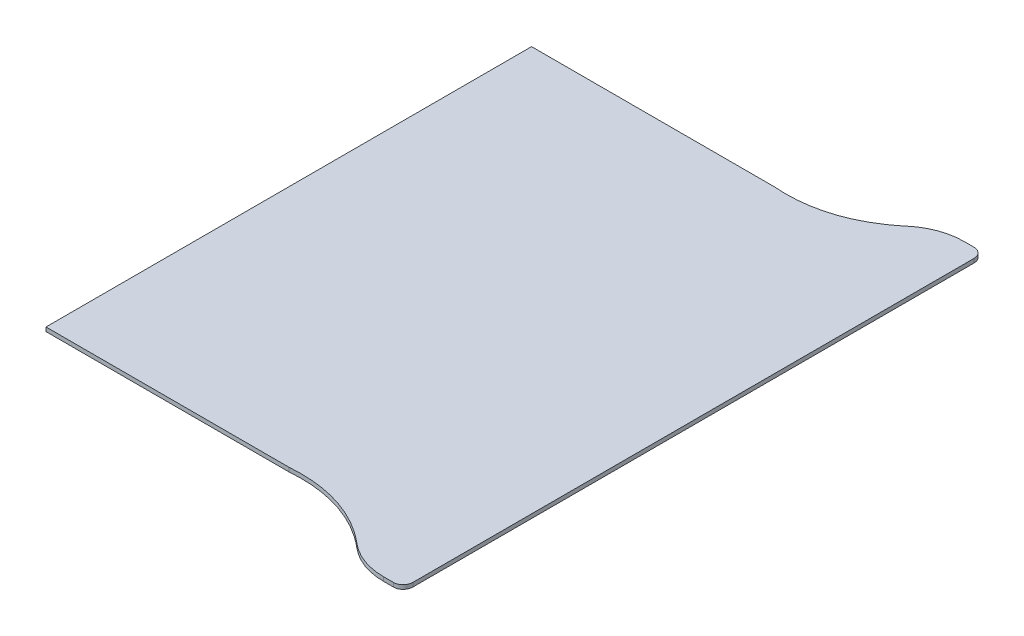
ISO-10303-21;
HEADER;
FILE_DESCRIPTION(('STEP AP214'),'2;1');
FILE_NAME('part.step','',(''),(''),'','','');
FILE_SCHEMA(('AUTOMOTIVE_DESIGN { 1 0 10303 214 1 1 1 1 }'));
ENDSEC;
DATA;
#1=APPLICATION_CONTEXT('core data for automotive mechanical design processes');
#2=APPLICATION_PROTOCOL_DEFINITION('international standard','automotive_design',2000,#1);
#3=PRODUCT_CONTEXT('',#1,'mechanical');
#4=PRODUCT('Part','Part','',(#3));
#5=PRODUCT_RELATED_PRODUCT_CATEGORY('part','',(#4));
#6=PRODUCT_DEFINITION_FORMATION('','',#4);
#7=PRODUCT_DEFINITION_CONTEXT('part definition',#1,'design');
#8=PRODUCT_DEFINITION('design','',#6,#7);
#9=PRODUCT_DEFINITION_SHAPE('','',#8);
#10=(LENGTH_UNIT() NAMED_UNIT(*) SI_UNIT(.MILLI.,.METRE.));
#11=(NAMED_UNIT(*) PLANE_ANGLE_UNIT() SI_UNIT($,.RADIAN.));
#12=(NAMED_UNIT(*) SI_UNIT($,.STERADIAN.) SOLID_ANGLE_UNIT());
#13=UNCERTAINTY_MEASURE_WITH_UNIT(LENGTH_MEASURE(1.E-05),#10,'distance_accuracy_value','');
#14=(GEOMETRIC_REPRESENTATION_CONTEXT(3) GLOBAL_UNCERTAINTY_ASSIGNED_CONTEXT((#13)) GLOBAL_UNIT_ASSIGNED_CONTEXT((#10,
#11,#12)) REPRESENTATION_CONTEXT('',''));
#15=CARTESIAN_POINT('',(0.,0.,0.));
#16=DIRECTION('',(0.,0.,1.));
#17=DIRECTION('',(1.,0.,0.));
#18=AXIS2_PLACEMENT_3D('',#15,#16,#17);
#19=CARTESIAN_POINT('',(0.,0.05,3.));
#20=DIRECTION('',(0.,0.,-1.));
#21=DIRECTION('',(-1.,0.,0.));
#22=AXIS2_PLACEMENT_3D('',#19,#20,#21);
#23=PLANE('',#22);
#24=DIRECTION('',(1.,0.,0.));
#25=VECTOR('',#24,1.);
#26=CARTESIAN_POINT('',(0.,0.,3.));
#27=LINE('',#26,#25);
#28=CARTESIAN_POINT('',(-1.5,0.,3.));
#29=VERTEX_POINT('',#28);
#30=CARTESIAN_POINT('',(1.5,0.,3.));
#31=VERTEX_POINT('',#30);
#32=EDGE_CURVE('E154',#29,#31,#27,.T.);
#33=ORIENTED_EDGE('',*,*,#32,.T.);
#34=DIRECTION('',(0.,-1.,0.));
#35=VECTOR('',#34,1.);
#36=CARTESIAN_POINT('',(1.5,0.05,3.));
#37=LINE('',#36,#35);
#38=CARTESIAN_POINT('',(1.5,0.05,3.));
#39=VERTEX_POINT('',#38);
#40=EDGE_CURVE('E11',#39,#31,#37,.T.);
#41=ORIENTED_EDGE('',*,*,#40,.F.);
#42=DIRECTION('',(1.,0.,0.));
#43=VECTOR('',#42,1.);
#44=CARTESIAN_POINT('',(0.,0.05,3.));
#45=LINE('',#44,#43);
#46=CARTESIAN_POINT('',(-1.5,0.05,3.));
#47=VERTEX_POINT('',#46);
#48=EDGE_CURVE('E191',#47,#39,#45,.T.);
#49=ORIENTED_EDGE('',*,*,#48,.F.);
#50=DIRECTION('',(0.,-1.,0.));
#51=VECTOR('',#50,1.);
#52=CARTESIAN_POINT('',(-1.5,0.05,3.));
#53=LINE('',#52,#51);
#54=EDGE_CURVE('E147',#47,#29,#53,.T.);
#55=ORIENTED_EDGE('',*,*,#54,.T.);
#56=EDGE_LOOP('',(#33,#41,#49,#55));
#57=FACE_BOUND('',#56,.T.);
#58=ADVANCED_FACE('F32',(#57),#23,.F.);
#59=CARTESIAN_POINT('',(1.5,0.05,3.));
#60=CARTESIAN_POINT('',(1.96120232579788,0.05,2.96255508986429));
#61=CARTESIAN_POINT('',(2.38723058127496,0.05,3.09925505725244));
#62=CARTESIAN_POINT('',(2.74013917213543,0.05,3.39785667069711));
#63=B_SPLINE_CURVE_WITH_KNOTS('',3,(#59,#60,#61,#62),.UNSPECIFIED.,.F.,.F.,(4,4),(0.,
0.839620689420537),.UNSPECIFIED.);
#64=DIRECTION('',(0.,-1.,0.));
#65=VECTOR('',#64,1.);
#66=SURFACE_OF_LINEAR_EXTRUSION('',#63,#65);
#67=CARTESIAN_POINT('',(1.5,0.,3.));
#68=CARTESIAN_POINT('',(1.96120232579788,0.,2.96255508986429));
#69=CARTESIAN_POINT('',(2.38723058127496,0.,3.09925505725244));
#70=CARTESIAN_POINT('',(2.74013917213543,0.,3.39785667069711));
#71=B_SPLINE_CURVE_WITH_KNOTS('',3,(#67,#68,#69,#70),.UNSPECIFIED.,.F.,.F.,(4,4),(0.,
0.839620689420537),.UNSPECIFIED.);
#72=CARTESIAN_POINT('',(2.74013917213542,0.,3.39785667069711));
#73=VERTEX_POINT('',#72);
#74=EDGE_CURVE('E157',#31,#73,#71,.T.);
#75=ORIENTED_EDGE('',*,*,#74,.T.);
#76=DIRECTION('',(0.,-1.,0.));
#77=VECTOR('',#76,1.);
#78=CARTESIAN_POINT('',(2.74013917213542,0.05,3.39785667069711));
#79=LINE('',#78,#77);
#80=CARTESIAN_POINT('',(2.74013917213542,0.05,3.39785667069711));
#81=VERTEX_POINT('',#80);
#82=EDGE_CURVE('E40',#81,#73,#79,.T.);
#83=ORIENTED_EDGE('',*,*,#82,.F.);
#84=EDGE_CURVE('E99',#39,#81,#63,.T.);
#85=ORIENTED_EDGE('',*,*,#84,.F.);
#86=ORIENTED_EDGE('',*,*,#40,.T.);
#87=EDGE_LOOP('',(#75,#83,#85,#86));
#88=FACE_BOUND('',#87,.T.);
#89=ADVANCED_FACE('F262',(#88),#66,.F.);
#90=CARTESIAN_POINT('',(3.25687950388828,0.05,2.78713625222402));
#91=DIRECTION('',(0.,-1.,0.));
#92=DIRECTION('',(0.,0.,-1.));
#93=AXIS2_PLACEMENT_3D('',#90,#91,#92);
#94=CYLINDRICAL_SURFACE('',#93,0.799999999999999);
#95=CARTESIAN_POINT('',(3.25687950388828,0.,2.78713625222402));
#96=DIRECTION('',(0.,1.,0.));
#97=DIRECTION('',(0.,0.,1.));
#98=AXIS2_PLACEMENT_3D('',#95,#96,#97);
#99=CIRCLE('',#98,0.799999999999999);
#100=CARTESIAN_POINT('',(3.25687950388828,0.,3.58713625222402));
#101=VERTEX_POINT('',#100);
#102=EDGE_CURVE('E161',#73,#101,#99,.T.);
#103=ORIENTED_EDGE('',*,*,#102,.T.);
#104=DIRECTION('',(0.,-1.,0.));
#105=VECTOR('',#104,1.);
#106=CARTESIAN_POINT('',(3.25687950388828,0.05,3.58713625222402));
#107=LINE('',#106,#105);
#108=CARTESIAN_POINT('',(3.25687950388828,0.05,3.58713625222402));
#109=VERTEX_POINT('',#108);
#110=EDGE_CURVE('E207',#109,#101,#107,.T.);
#111=ORIENTED_EDGE('',*,*,#110,.F.);
#112=CARTESIAN_POINT('',(3.25687950388828,0.05,2.78713625222402));
#113=DIRECTION('',(0.,1.,0.));
#114=DIRECTION('',(0.,0.,1.));
#115=AXIS2_PLACEMENT_3D('',#112,#113,#114);
#116=CIRCLE('',#115,0.799999999999999);
#117=EDGE_CURVE('E215',#81,#109,#116,.T.);
#118=ORIENTED_EDGE('',*,*,#117,.F.);
#119=ORIENTED_EDGE('',*,*,#82,.T.);
#120=EDGE_LOOP('',(#103,#111,#118,#119));
#121=FACE_BOUND('',#120,.T.);
#122=ADVANCED_FACE('F213',(#121),#94,.T.);
#123=CARTESIAN_POINT('',(0.,0.05,3.58713625222402));
#124=DIRECTION('',(0.,0.,-1.));
#125=DIRECTION('',(-1.,0.,0.));
#126=AXIS2_PLACEMENT_3D('',#123,#124,#125);
#127=PLANE('',#126);
#128=DIRECTION('',(1.,0.,0.));
#129=VECTOR('',#128,1.);
#130=CARTESIAN_POINT('',(0.,0.,3.58713625222402));
#131=LINE('',#130,#129);
#132=CARTESIAN_POINT('',(3.38,0.,3.58713625222402));
#133=VERTEX_POINT('',#132);
#134=EDGE_CURVE('E166',#101,#133,#131,.T.);
#135=ORIENTED_EDGE('',*,*,#134,.T.);
#136=DIRECTION('',(0.,-1.,0.));
#137=VECTOR('',#136,1.);
#138=CARTESIAN_POINT('',(3.38,0.05,3.58713625222402));
#139=LINE('',#138,#137);
#140=CARTESIAN_POINT('',(3.38,0.05,3.58713625222402));
#141=VERTEX_POINT('',#140);
#142=EDGE_CURVE('E204',#141,#133,#139,.T.);
#143=ORIENTED_EDGE('',*,*,#142,.F.);
#144=DIRECTION('',(1.,0.,0.));
#145=VECTOR('',#144,1.);
#146=CARTESIAN_POINT('',(0.,0.05,3.58713625222402));
#147=LINE('',#146,#145);
#148=EDGE_CURVE('E233',#109,#141,#147,.T.);
#149=ORIENTED_EDGE('',*,*,#148,.F.);
#150=ORIENTED_EDGE('',*,*,#110,.T.);
#151=EDGE_LOOP('',(#135,#143,#149,#150));
#152=FACE_BOUND('',#151,.T.);
#153=ADVANCED_FACE('F224',(#152),#127,.F.);
#154=CARTESIAN_POINT('',(3.38,0.05,3.46713625222402));
#155=DIRECTION('',(0.,-1.,0.));
#156=DIRECTION('',(0.,0.,-1.));
#157=AXIS2_PLACEMENT_3D('',#154,#155,#156);
#158=CYLINDRICAL_SURFACE('',#157,0.12);
#159=CARTESIAN_POINT('',(3.38,0.,3.46713625222402));
#160=DIRECTION('',(0.,1.,0.));
#161=DIRECTION('',(0.,0.,1.));
#162=AXIS2_PLACEMENT_3D('',#159,#160,#161);
#163=CIRCLE('',#162,0.12);
#164=CARTESIAN_POINT('',(3.5,0.,3.46713625222402));
#165=VERTEX_POINT('',#164);
#166=EDGE_CURVE('E168',#133,#165,#163,.T.);
#167=ORIENTED_EDGE('',*,*,#166,.T.);
#168=DIRECTION('',(0.,-1.,0.));
#169=VECTOR('',#168,1.);
#170=CARTESIAN_POINT('',(3.5,0.05,3.46713625222402));
#171=LINE('',#170,#169);
#172=CARTESIAN_POINT('',(3.5,0.05,3.46713625222402));
#173=VERTEX_POINT('',#172);
#174=EDGE_CURVE('E201',#173,#165,#171,.T.);
#175=ORIENTED_EDGE('',*,*,#174,.F.);
#176=CARTESIAN_POINT('',(3.38,0.05,3.46713625222402));
#177=DIRECTION('',(0.,1.,0.));
#178=DIRECTION('',(0.,0.,1.));
#179=AXIS2_PLACEMENT_3D('',#176,#177,#178);
#180=CIRCLE('',#179,0.12);
#181=EDGE_CURVE('E230',#141,#173,#180,.T.);
#182=ORIENTED_EDGE('',*,*,#181,.F.);
#183=ORIENTED_EDGE('',*,*,#142,.T.);
#184=EDGE_LOOP('',(#167,#175,#182,#183));
#185=FACE_BOUND('',#184,.T.);
#186=ADVANCED_FACE('F228',(#185),#158,.T.);
#187=CARTESIAN_POINT('',(3.5,0.05,0.));
#188=DIRECTION('',(-1.,0.,0.));
#189=DIRECTION('',(0.,0.,1.));
#190=AXIS2_PLACEMENT_3D('',#187,#188,#189);
#191=PLANE('',#190);
#192=DIRECTION('',(0.,0.,-1.));
#193=VECTOR('',#192,1.);
#194=CARTESIAN_POINT('',(3.5,0.,0.));
#195=LINE('',#194,#193);
#196=CARTESIAN_POINT('',(3.5,0.,-3.46713625222402));
#197=VERTEX_POINT('',#196);
#198=EDGE_CURVE('E170',#165,#197,#195,.T.);
#199=ORIENTED_EDGE('',*,*,#198,.T.);
#200=DIRECTION('',(0.,-1.,0.));
#201=VECTOR('',#200,1.);
#202=CARTESIAN_POINT('',(3.5,0.05,-3.46713625222402));
#203=LINE('',#202,#201);
#204=CARTESIAN_POINT('',(3.5,0.05,-3.46713625222402));
#205=VERTEX_POINT('',#204);
#206=EDGE_CURVE('E199',#205,#197,#203,.T.);
#207=ORIENTED_EDGE('',*,*,#206,.F.);
#208=DIRECTION('',(0.,0.,-1.));
#209=VECTOR('',#208,1.);
#210=CARTESIAN_POINT('',(3.5,0.05,0.));
#211=LINE('',#210,#209);
#212=EDGE_CURVE('E232',#173,#205,#211,.T.);
#213=ORIENTED_EDGE('',*,*,#212,.F.);
#214=ORIENTED_EDGE('',*,*,#174,.T.);
#215=EDGE_LOOP('',(#199,#207,#213,#214));
#216=FACE_BOUND('',#215,.T.);
#217=ADVANCED_FACE('F283',(#216),#191,.F.);
#218=CARTESIAN_POINT('',(3.38,0.05,-3.46713625222402));
#219=DIRECTION('',(0.,-1.,0.));
#220=DIRECTION('',(0.,0.,-1.));
#221=AXIS2_PLACEMENT_3D('',#218,#219,#220);
#222=CYLINDRICAL_SURFACE('',#221,0.12);
#223=CARTESIAN_POINT('',(3.38,0.,-3.46713625222402));
#224=DIRECTION('',(0.,1.,0.));
#225=DIRECTION('',(0.,0.,1.));
#226=AXIS2_PLACEMENT_3D('',#223,#224,#225);
#227=CIRCLE('',#226,0.12);
#228=CARTESIAN_POINT('',(3.38,0.,-3.58713625222402));
#229=VERTEX_POINT('',#228);
#230=EDGE_CURVE('E173',#229,#197,#227,.F.);
#231=ORIENTED_EDGE('',*,*,#230,.F.);
#232=DIRECTION('',(0.,-1.,0.));
#233=VECTOR('',#232,1.);
#234=CARTESIAN_POINT('',(3.38,0.05,-3.58713625222402));
#235=LINE('',#234,#233);
#236=CARTESIAN_POINT('',(3.38,0.05,-3.58713625222402));
#237=VERTEX_POINT('',#236);
#238=EDGE_CURVE('E197',#237,#229,#235,.T.);
#239=ORIENTED_EDGE('',*,*,#238,.F.);
#240=CARTESIAN_POINT('',(3.38,0.05,-3.46713625222402));
#241=DIRECTION('',(0.,1.,0.));
#242=DIRECTION('',(0.,0.,1.));
#243=AXIS2_PLACEMENT_3D('',#240,#241,#242);
#244=CIRCLE('',#243,0.12);
#245=EDGE_CURVE('E235',#237,#205,#244,.F.);
#246=ORIENTED_EDGE('',*,*,#245,.T.);
#247=ORIENTED_EDGE('',*,*,#206,.T.);
#248=EDGE_LOOP('',(#231,#239,#246,#247));
#249=FACE_BOUND('',#248,.T.);
#250=ADVANCED_FACE('F286',(#249),#222,.T.);
#251=CARTESIAN_POINT('',(0.,0.05,-3.58713625222402));
#252=DIRECTION('',(0.,0.,-1.));
#253=DIRECTION('',(-1.,0.,0.));
#254=AXIS2_PLACEMENT_3D('',#251,#252,#253);
#255=PLANE('',#254);
#256=DIRECTION('',(1.,0.,0.));
#257=VECTOR('',#256,1.);
#258=CARTESIAN_POINT('',(0.,0.,-3.58713625222402));
#259=LINE('',#258,#257);
#260=CARTESIAN_POINT('',(3.25687950388829,0.,-3.58713625222402));
#261=VERTEX_POINT('',#260);
#262=EDGE_CURVE('E176',#261,#229,#259,.T.);
#263=ORIENTED_EDGE('',*,*,#262,.F.);
#264=DIRECTION('',(0.,-1.,0.));
#265=VECTOR('',#264,1.);
#266=CARTESIAN_POINT('',(3.25687950388829,0.05,-3.58713625222402));
#267=LINE('',#266,#265);
#268=CARTESIAN_POINT('',(3.25687950388829,0.05,-3.58713625222402));
#269=VERTEX_POINT('',#268);
#270=EDGE_CURVE('E195',#269,#261,#267,.T.);
#271=ORIENTED_EDGE('',*,*,#270,.F.);
#272=DIRECTION('',(1.,0.,0.));
#273=VECTOR('',#272,1.);
#274=CARTESIAN_POINT('',(0.,0.05,-3.58713625222402));
#275=LINE('',#274,#273);
#276=EDGE_CURVE('E242',#269,#237,#275,.T.);
#277=ORIENTED_EDGE('',*,*,#276,.T.);
#278=ORIENTED_EDGE('',*,*,#238,.T.);
#279=EDGE_LOOP('',(#263,#271,#277,#278));
#280=FACE_BOUND('',#279,.T.);
#281=ADVANCED_FACE('F290',(#280),#255,.T.);
#282=CARTESIAN_POINT('',(3.25687950388829,0.05,-2.78713625222402));
#283=DIRECTION('',(0.,-1.,0.));
#284=DIRECTION('',(0.,0.,-1.));
#285=AXIS2_PLACEMENT_3D('',#282,#283,#284);
#286=CYLINDRICAL_SURFACE('',#285,0.8);
#287=CARTESIAN_POINT('',(3.25687950388829,0.,-2.78713625222402));
#288=DIRECTION('',(0.,1.,0.));
#289=DIRECTION('',(0.,0.,1.));
#290=AXIS2_PLACEMENT_3D('',#287,#288,#289);
#291=CIRCLE('',#290,0.8);
#292=CARTESIAN_POINT('',(2.74013917213543,0.,-3.39785667069711));
#293=VERTEX_POINT('',#292);
#294=EDGE_CURVE('E179',#293,#261,#291,.F.);
#295=ORIENTED_EDGE('',*,*,#294,.F.);
#296=DIRECTION('',(0.,-1.,0.));
#297=VECTOR('',#296,1.);
#298=CARTESIAN_POINT('',(2.74013917213543,0.05,-3.39785667069711));
#299=LINE('',#298,#297);
#300=CARTESIAN_POINT('',(2.74013917213543,0.05,-3.39785667069711));
#301=VERTEX_POINT('',#300);
#302=EDGE_CURVE('E136',#301,#293,#299,.T.);
#303=ORIENTED_EDGE('',*,*,#302,.F.);
#304=CARTESIAN_POINT('',(3.25687950388829,0.05,-2.78713625222402));
#305=DIRECTION('',(0.,1.,0.));
#306=DIRECTION('',(0.,0.,1.));
#307=AXIS2_PLACEMENT_3D('',#304,#305,#306);
#308=CIRCLE('',#307,0.8);
#309=EDGE_CURVE('E143',#301,#269,#308,.F.);
#310=ORIENTED_EDGE('',*,*,#309,.T.);
#311=ORIENTED_EDGE('',*,*,#270,.T.);
#312=EDGE_LOOP('',(#295,#303,#310,#311));
#313=FACE_BOUND('',#312,.T.);
#314=ADVANCED_FACE('F246',(#313),#286,.T.);
#315=CARTESIAN_POINT('',(1.5,0.05,-3.));
#316=CARTESIAN_POINT('',(1.96120232579788,0.05,-2.96255508986429));
#317=CARTESIAN_POINT('',(2.38723058127496,0.05,-3.09925505725244));
#318=CARTESIAN_POINT('',(2.74013917213543,0.05,-3.39785667069711));
#319=B_SPLINE_CURVE_WITH_KNOTS('',3,(#315,#316,#317,#318),.UNSPECIFIED.,.F.,.F.,(4,4),(0.,
0.839620689420537),.UNSPECIFIED.);
#320=DIRECTION('',(0.,-1.,0.));
#321=VECTOR('',#320,1.);
#322=SURFACE_OF_LINEAR_EXTRUSION('',#319,#321);
#323=CARTESIAN_POINT('',(1.5,0.,-3.));
#324=CARTESIAN_POINT('',(1.96120232579788,0.,-2.96255508986429));
#325=CARTESIAN_POINT('',(2.38723058127496,0.,-3.09925505725244));
#326=CARTESIAN_POINT('',(2.74013917213543,0.,-3.39785667069711));
#327=B_SPLINE_CURVE_WITH_KNOTS('',3,(#323,#324,#325,#326),.UNSPECIFIED.,.F.,.F.,(4,4),(0.,
0.839620689420537),.UNSPECIFIED.);
#328=CARTESIAN_POINT('',(1.5,0.,-3.));
#329=VERTEX_POINT('',#328);
#330=EDGE_CURVE('E131',#329,#293,#327,.T.);
#331=ORIENTED_EDGE('',*,*,#330,.F.);
#332=DIRECTION('',(0.,-1.,0.));
#333=VECTOR('',#332,1.);
#334=CARTESIAN_POINT('',(1.5,0.05,-3.));
#335=LINE('',#334,#333);
#336=CARTESIAN_POINT('',(1.5,0.05,-3.));
#337=VERTEX_POINT('',#336);
#338=EDGE_CURVE('E126',#337,#329,#335,.T.);
#339=ORIENTED_EDGE('',*,*,#338,.F.);
#340=EDGE_CURVE('E129',#337,#301,#319,.T.);
#341=ORIENTED_EDGE('',*,*,#340,.T.);
#342=ORIENTED_EDGE('',*,*,#302,.T.);
#343=EDGE_LOOP('',(#331,#339,#341,#342));
#344=FACE_BOUND('',#343,.T.);
#345=ADVANCED_FACE('F128',(#344),#322,.T.);
#346=CARTESIAN_POINT('',(0.,0.05,-3.));
#347=DIRECTION('',(0.,0.,-1.));
#348=DIRECTION('',(-1.,0.,0.));
#349=AXIS2_PLACEMENT_3D('',#346,#347,#348);
#350=PLANE('',#349);
#351=DIRECTION('',(1.,0.,0.));
#352=VECTOR('',#351,1.);
#353=CARTESIAN_POINT('',(0.,0.,-3.));
#354=LINE('',#353,#352);
#355=CARTESIAN_POINT('',(-1.5,0.,-3.));
#356=VERTEX_POINT('',#355);
#357=EDGE_CURVE('E185',#356,#329,#354,.T.);
#358=ORIENTED_EDGE('',*,*,#357,.F.);
#359=DIRECTION('',(0.,-1.,0.));
#360=VECTOR('',#359,1.);
#361=CARTESIAN_POINT('',(-1.5,0.05,-3.));
#362=LINE('',#361,#360);
#363=CARTESIAN_POINT('',(-1.5,0.05,-3.));
#364=VERTEX_POINT('',#363);
#365=EDGE_CURVE('E88',#364,#356,#362,.T.);
#366=ORIENTED_EDGE('',*,*,#365,.F.);
#367=DIRECTION('',(1.,0.,0.));
#368=VECTOR('',#367,1.);
#369=CARTESIAN_POINT('',(0.,0.05,-3.));
#370=LINE('',#369,#368);
#371=EDGE_CURVE('E140',#364,#337,#370,.T.);
#372=ORIENTED_EDGE('',*,*,#371,.T.);
#373=ORIENTED_EDGE('',*,*,#338,.T.);
#374=EDGE_LOOP('',(#358,#366,#372,#373));
#375=FACE_BOUND('',#374,.T.);
#376=ADVANCED_FACE('F145',(#375),#350,.T.);
#377=CARTESIAN_POINT('',(-1.5,0.05,0.));
#378=DIRECTION('',(1.,0.,0.));
#379=DIRECTION('',(0.,0.,-1.));
#380=AXIS2_PLACEMENT_3D('',#377,#378,#379);
#381=PLANE('',#380);
#382=DIRECTION('',(0.,0.,1.));
#383=VECTOR('',#382,1.);
#384=CARTESIAN_POINT('',(-1.5,0.,0.));
#385=LINE('',#384,#383);
#386=EDGE_CURVE('E91',#356,#29,#385,.T.);
#387=ORIENTED_EDGE('',*,*,#386,.T.);
#388=ORIENTED_EDGE('',*,*,#54,.F.);
#389=DIRECTION('',(0.,0.,1.));
#390=VECTOR('',#389,1.);
#391=CARTESIAN_POINT('',(-1.5,0.05,0.));
#392=LINE('',#391,#390);
#393=EDGE_CURVE('E48',#364,#47,#392,.T.);
#394=ORIENTED_EDGE('',*,*,#393,.F.);
#395=ORIENTED_EDGE('',*,*,#365,.T.);
#396=EDGE_LOOP('',(#387,#388,#394,#395));
#397=FACE_BOUND('',#396,.T.);
#398=ADVANCED_FACE('F251',(#397),#381,.F.);
#399=CARTESIAN_POINT('',(0.,0.05,0.));
#400=DIRECTION('',(0.,1.,0.));
#401=DIRECTION('',(0.,0.,1.));
#402=AXIS2_PLACEMENT_3D('',#399,#400,#401);
#403=PLANE('',#402);
#404=ORIENTED_EDGE('',*,*,#48,.T.);
#405=ORIENTED_EDGE('',*,*,#84,.T.);
#406=ORIENTED_EDGE('',*,*,#117,.T.);
#407=ORIENTED_EDGE('',*,*,#148,.T.);
#408=ORIENTED_EDGE('',*,*,#181,.T.);
#409=ORIENTED_EDGE('',*,*,#212,.T.);
#410=ORIENTED_EDGE('',*,*,#245,.F.);
#411=ORIENTED_EDGE('',*,*,#276,.F.);
#412=ORIENTED_EDGE('',*,*,#309,.F.);
#413=ORIENTED_EDGE('',*,*,#340,.F.);
#414=ORIENTED_EDGE('',*,*,#371,.F.);
#415=ORIENTED_EDGE('',*,*,#393,.T.);
#416=EDGE_LOOP('',(#404,#405,#406,#407,#408,#409,#410,#411,#412,#413,#414,#415));
#417=FACE_BOUND('',#416,.T.);
#418=ADVANCED_FACE('F139',(#417),#403,.T.);
#419=CARTESIAN_POINT('',(0.,0.,0.));
#420=DIRECTION('',(0.,1.,0.));
#421=DIRECTION('',(0.,0.,1.));
#422=AXIS2_PLACEMENT_3D('',#419,#420,#421);
#423=PLANE('',#422);
#424=ORIENTED_EDGE('',*,*,#32,.F.);
#425=ORIENTED_EDGE('',*,*,#386,.F.);
#426=ORIENTED_EDGE('',*,*,#357,.T.);
#427=ORIENTED_EDGE('',*,*,#330,.T.);
#428=ORIENTED_EDGE('',*,*,#294,.T.);
#429=ORIENTED_EDGE('',*,*,#262,.T.);
#430=ORIENTED_EDGE('',*,*,#230,.T.);
#431=ORIENTED_EDGE('',*,*,#198,.F.);
#432=ORIENTED_EDGE('',*,*,#166,.F.);
#433=ORIENTED_EDGE('',*,*,#134,.F.);
#434=ORIENTED_EDGE('',*,*,#102,.F.);
#435=ORIENTED_EDGE('',*,*,#74,.F.);
#436=EDGE_LOOP('',(#424,#425,#426,#427,#428,#429,#430,#431,#432,#433,#434,#435));
#437=FACE_BOUND('',#436,.T.);
#438=ADVANCED_FACE('F219',(#437),#423,.F.);
#439=CLOSED_SHELL('',(#58,#89,#122,#153,#186,#217,#250,#281,#314,#345,#376,#398,#418,#438));
#440=MANIFOLD_SOLID_BREP('B2',#439);
#441=ADVANCED_BREP_SHAPE_REPRESENTATION('',(#18,#440),#14);
#442=SHAPE_DEFINITION_REPRESENTATION(#9,#441);
ENDSEC;
END-ISO-10303-21;
